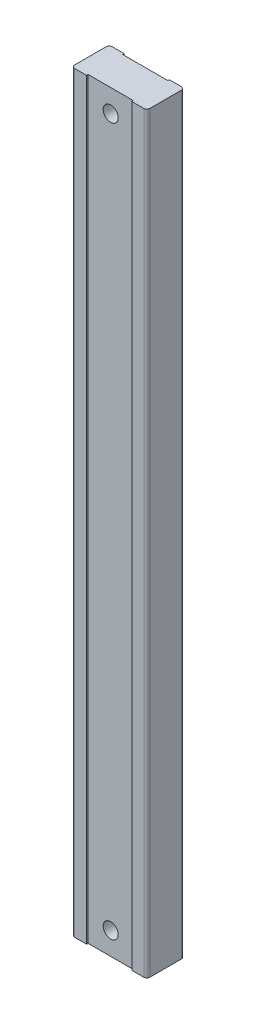
ISO-10303-21;
HEADER;
FILE_DESCRIPTION(('STEP AP214'),'2;1');
FILE_NAME('part.step','',(''),(''),'','','');
FILE_SCHEMA(('AUTOMOTIVE_DESIGN { 1 0 10303 214 1 1 1 1 }'));
ENDSEC;
DATA;
#1=APPLICATION_CONTEXT('core data for automotive mechanical design processes');
#2=APPLICATION_PROTOCOL_DEFINITION('international standard','automotive_design',2000,#1);
#3=PRODUCT_CONTEXT('',#1,'mechanical');
#4=PRODUCT('Part','Part','',(#3));
#5=PRODUCT_RELATED_PRODUCT_CATEGORY('part','',(#4));
#6=PRODUCT_DEFINITION_FORMATION('','',#4);
#7=PRODUCT_DEFINITION_CONTEXT('part definition',#1,'design');
#8=PRODUCT_DEFINITION('design','',#6,#7);
#9=PRODUCT_DEFINITION_SHAPE('','',#8);
#10=(LENGTH_UNIT() NAMED_UNIT(*) SI_UNIT(.MILLI.,.METRE.));
#11=(NAMED_UNIT(*) PLANE_ANGLE_UNIT() SI_UNIT($,.RADIAN.));
#12=(NAMED_UNIT(*) SI_UNIT($,.STERADIAN.) SOLID_ANGLE_UNIT());
#13=UNCERTAINTY_MEASURE_WITH_UNIT(LENGTH_MEASURE(1.E-05),#10,'distance_accuracy_value','');
#14=(GEOMETRIC_REPRESENTATION_CONTEXT(3) GLOBAL_UNCERTAINTY_ASSIGNED_CONTEXT((#13)) GLOBAL_UNIT_ASSIGNED_CONTEXT((#10,
#11,#12)) REPRESENTATION_CONTEXT('',''));
#15=CARTESIAN_POINT('',(0.,0.,0.));
#16=DIRECTION('',(0.,0.,1.));
#17=DIRECTION('',(1.,0.,0.));
#18=AXIS2_PLACEMENT_3D('',#15,#16,#17);
#19=CARTESIAN_POINT('',(-73.9038841324201,500.,23.3090667808219));
#20=DIRECTION('',(0.,0.,-1.));
#21=DIRECTION('',(-1.,0.,0.));
#22=AXIS2_PLACEMENT_3D('',#19,#20,#21);
#23=PLANE('',#22);
#24=DIRECTION('',(1.,0.,0.));
#25=VECTOR('',#24,1.);
#26=CARTESIAN_POINT('',(-73.9038841324201,0.,23.3090667808219));
#27=LINE('',#26,#25);
#28=CARTESIAN_POINT('',(-73.9038841324201,0.,23.3090667808219));
#29=VERTEX_POINT('',#28);
#30=CARTESIAN_POINT('',(-65.9038841324201,0.,23.3090667808219));
#31=VERTEX_POINT('',#30);
#32=EDGE_CURVE('E160',#29,#31,#27,.T.);
#33=ORIENTED_EDGE('',*,*,#32,.T.);
#34=DIRECTION('',(0.,1.,0.));
#35=VECTOR('',#34,1.);
#36=CARTESIAN_POINT('',(-65.9038841324201,0.,23.3090667808219));
#37=LINE('',#36,#35);
#38=CARTESIAN_POINT('',(-65.9038841324201,500.,23.3090667808219));
#39=VERTEX_POINT('',#38);
#40=EDGE_CURVE('E146',#31,#39,#37,.T.);
#41=ORIENTED_EDGE('',*,*,#40,.T.);
#42=DIRECTION('',(1.,0.,0.));
#43=VECTOR('',#42,1.);
#44=CARTESIAN_POINT('',(-73.9038841324201,500.,23.3090667808219));
#45=LINE('',#44,#43);
#46=CARTESIAN_POINT('',(-73.9038841324201,500.,23.3090667808219));
#47=VERTEX_POINT('',#46);
#48=EDGE_CURVE('E254',#47,#39,#45,.T.);
#49=ORIENTED_EDGE('',*,*,#48,.F.);
#50=DIRECTION('',(0.,-1.,0.));
#51=VECTOR('',#50,1.);
#52=CARTESIAN_POINT('',(-73.9038841324201,500.,23.3090667808219));
#53=LINE('',#52,#51);
#54=EDGE_CURVE('E11',#47,#29,#53,.T.);
#55=ORIENTED_EDGE('',*,*,#54,.T.);
#56=EDGE_LOOP('',(#33,#41,#49,#55));
#57=FACE_BOUND('',#56,.T.);
#58=ADVANCED_FACE('F33',(#57),#23,.F.);
#59=CARTESIAN_POINT('',(-73.9038841324201,500.,-1.69093321917808));
#60=DIRECTION('',(0.,0.,1.));
#61=DIRECTION('',(1.,0.,0.));
#62=AXIS2_PLACEMENT_3D('',#59,#60,#61);
#63=PLANE('',#62);
#64=DIRECTION('',(-1.,0.,0.));
#65=VECTOR('',#64,1.);
#66=CARTESIAN_POINT('',(-73.9038841324201,500.,-1.69093321917808));
#67=LINE('',#66,#65);
#68=CARTESIAN_POINT('',(-65.9038841324201,500.,-1.69093321917808));
#69=VERTEX_POINT('',#68);
#70=CARTESIAN_POINT('',(-73.9038841324201,500.,-1.69093321917808));
#71=VERTEX_POINT('',#70);
#72=EDGE_CURVE('E232',#69,#71,#67,.T.);
#73=ORIENTED_EDGE('',*,*,#72,.F.);
#74=DIRECTION('',(0.,1.,0.));
#75=VECTOR('',#74,1.);
#76=CARTESIAN_POINT('',(-65.9038841324201,0.,-1.69093321917808));
#77=LINE('',#76,#75);
#78=CARTESIAN_POINT('',(-65.9038841324201,0.,-1.69093321917808));
#79=VERTEX_POINT('',#78);
#80=EDGE_CURVE('E287',#79,#69,#77,.T.);
#81=ORIENTED_EDGE('',*,*,#80,.F.);
#82=DIRECTION('',(-1.,0.,0.));
#83=VECTOR('',#82,1.);
#84=CARTESIAN_POINT('',(-73.9038841324201,0.,-1.69093321917808));
#85=LINE('',#84,#83);
#86=CARTESIAN_POINT('',(-73.9038841324201,0.,-1.69093321917808));
#87=VERTEX_POINT('',#86);
#88=EDGE_CURVE('E179',#79,#87,#85,.T.);
#89=ORIENTED_EDGE('',*,*,#88,.T.);
#90=DIRECTION('',(0.,-1.,0.));
#91=VECTOR('',#90,1.);
#92=CARTESIAN_POINT('',(-73.9038841324201,500.,-1.69093321917808));
#93=LINE('',#92,#91);
#94=EDGE_CURVE('E195',#71,#87,#93,.T.);
#95=ORIENTED_EDGE('',*,*,#94,.F.);
#96=EDGE_LOOP('',(#73,#81,#89,#95));
#97=FACE_BOUND('',#96,.T.);
#98=ADVANCED_FACE('F308',(#97),#63,.F.);
#99=CARTESIAN_POINT('',(-73.9038841324201,500.,21.3090667808219));
#100=DIRECTION('',(0.,-1.,0.));
#101=DIRECTION('',(0.,0.,-1.));
#102=AXIS2_PLACEMENT_3D('',#99,#100,#101);
#103=CYLINDRICAL_SURFACE('',#102,2.);
#104=CARTESIAN_POINT('',(-73.9038841324201,0.,21.3090667808219));
#105=DIRECTION('',(0.,1.,0.));
#106=DIRECTION('',(0.,0.,-1.));
#107=AXIS2_PLACEMENT_3D('',#104,#105,#106);
#108=CIRCLE('',#107,2.);
#109=CARTESIAN_POINT('',(-75.9038841324201,0.,21.3090667808219));
#110=VERTEX_POINT('',#109);
#111=EDGE_CURVE('E172',#110,#29,#108,.T.);
#112=ORIENTED_EDGE('',*,*,#111,.T.);
#113=ORIENTED_EDGE('',*,*,#54,.F.);
#114=CARTESIAN_POINT('',(-73.9038841324201,500.,21.3090667808219));
#115=DIRECTION('',(0.,1.,0.));
#116=DIRECTION('',(0.,0.,-1.));
#117=AXIS2_PLACEMENT_3D('',#114,#115,#116);
#118=CIRCLE('',#117,2.);
#119=CARTESIAN_POINT('',(-75.9038841324201,500.,21.3090667808219));
#120=VERTEX_POINT('',#119);
#121=EDGE_CURVE('E187',#120,#47,#118,.T.);
#122=ORIENTED_EDGE('',*,*,#121,.F.);
#123=DIRECTION('',(0.,-1.,0.));
#124=VECTOR('',#123,1.);
#125=CARTESIAN_POINT('',(-75.9038841324201,500.,21.3090667808219));
#126=LINE('',#125,#124);
#127=EDGE_CURVE('E188',#120,#110,#126,.T.);
#128=ORIENTED_EDGE('',*,*,#127,.T.);
#129=EDGE_LOOP('',(#112,#113,#122,#128));
#130=FACE_BOUND('',#129,.T.);
#131=ADVANCED_FACE('F35',(#130),#103,.T.);
#132=CARTESIAN_POINT('',(-35.9038841324201,500.,23.3090667808219));
#133=VERTEX_POINT('',#132);
#134=CARTESIAN_POINT('',(-27.9038841324201,500.,23.3090667808219));
#135=VERTEX_POINT('',#134);
#136=EDGE_CURVE('E252',#133,#135,#45,.T.);
#137=ORIENTED_EDGE('',*,*,#136,.F.);
#138=DIRECTION('',(0.,1.,0.));
#139=VECTOR('',#138,1.);
#140=CARTESIAN_POINT('',(-35.9038841324201,0.,23.3090667808219));
#141=LINE('',#140,#139);
#142=CARTESIAN_POINT('',(-35.9038841324201,0.,23.3090667808219));
#143=VERTEX_POINT('',#142);
#144=EDGE_CURVE('E155',#143,#133,#141,.T.);
#145=ORIENTED_EDGE('',*,*,#144,.F.);
#146=CARTESIAN_POINT('',(-27.9038841324201,0.,23.3090667808219));
#147=VERTEX_POINT('',#146);
#148=EDGE_CURVE('E168',#143,#147,#27,.T.);
#149=ORIENTED_EDGE('',*,*,#148,.T.);
#150=DIRECTION('',(0.,-1.,0.));
#151=VECTOR('',#150,1.);
#152=CARTESIAN_POINT('',(-27.9038841324201,500.,23.3090667808219));
#153=LINE('',#152,#151);
#154=EDGE_CURVE('E41',#135,#147,#153,.T.);
#155=ORIENTED_EDGE('',*,*,#154,.F.);
#156=EDGE_LOOP('',(#137,#145,#149,#155));
#157=FACE_BOUND('',#156,.T.);
#158=ADVANCED_FACE('F264',(#157),#23,.F.);
#159=CARTESIAN_POINT('',(-27.9038841324201,500.,21.3090667808219));
#160=DIRECTION('',(0.,-1.,0.));
#161=DIRECTION('',(0.,0.,-1.));
#162=AXIS2_PLACEMENT_3D('',#159,#160,#161);
#163=CYLINDRICAL_SURFACE('',#162,2.);
#164=CARTESIAN_POINT('',(-27.9038841324201,0.,21.3090667808219));
#165=DIRECTION('',(0.,1.,0.));
#166=DIRECTION('',(0.,0.,-1.));
#167=AXIS2_PLACEMENT_3D('',#164,#165,#166);
#168=CIRCLE('',#167,2.);
#169=CARTESIAN_POINT('',(-25.9038841324201,0.,21.3090667808219));
#170=VERTEX_POINT('',#169);
#171=EDGE_CURVE('E167',#147,#170,#168,.T.);
#172=ORIENTED_EDGE('',*,*,#171,.T.);
#173=DIRECTION('',(0.,-1.,0.));
#174=VECTOR('',#173,1.);
#175=CARTESIAN_POINT('',(-25.9038841324201,500.,21.3090667808219));
#176=LINE('',#175,#174);
#177=CARTESIAN_POINT('',(-25.9038841324201,500.,21.3090667808219));
#178=VERTEX_POINT('',#177);
#179=EDGE_CURVE('E204',#178,#170,#176,.T.);
#180=ORIENTED_EDGE('',*,*,#179,.F.);
#181=CARTESIAN_POINT('',(-27.9038841324201,500.,21.3090667808219));
#182=DIRECTION('',(0.,1.,0.));
#183=DIRECTION('',(0.,0.,-1.));
#184=AXIS2_PLACEMENT_3D('',#181,#182,#183);
#185=CIRCLE('',#184,2.);
#186=EDGE_CURVE('E213',#135,#178,#185,.T.);
#187=ORIENTED_EDGE('',*,*,#186,.F.);
#188=ORIENTED_EDGE('',*,*,#154,.T.);
#189=EDGE_LOOP('',(#172,#180,#187,#188));
#190=FACE_BOUND('',#189,.T.);
#191=ADVANCED_FACE('F211',(#190),#163,.T.);
#192=CARTESIAN_POINT('',(-25.9038841324201,500.,0.309066780821921));
#193=DIRECTION('',(-1.,0.,0.));
#194=DIRECTION('',(0.,0.,1.));
#195=AXIS2_PLACEMENT_3D('',#192,#193,#194);
#196=PLANE('',#195);
#197=DIRECTION('',(0.,0.,-1.));
#198=VECTOR('',#197,1.);
#199=CARTESIAN_POINT('',(-25.9038841324201,0.,0.309066780821921));
#200=LINE('',#199,#198);
#201=CARTESIAN_POINT('',(-25.9038841324201,0.,0.309066780821921));
#202=VERTEX_POINT('',#201);
#203=EDGE_CURVE('E170',#170,#202,#200,.T.);
#204=ORIENTED_EDGE('',*,*,#203,.T.);
#205=DIRECTION('',(0.,-1.,0.));
#206=VECTOR('',#205,1.);
#207=CARTESIAN_POINT('',(-25.9038841324201,500.,0.309066780821921));
#208=LINE('',#207,#206);
#209=CARTESIAN_POINT('',(-25.9038841324201,500.,0.309066780821921));
#210=VERTEX_POINT('',#209);
#211=EDGE_CURVE('E201',#210,#202,#208,.T.);
#212=ORIENTED_EDGE('',*,*,#211,.F.);
#213=DIRECTION('',(0.,0.,-1.));
#214=VECTOR('',#213,1.);
#215=CARTESIAN_POINT('',(-25.9038841324201,500.,0.309066780821921));
#216=LINE('',#215,#214);
#217=EDGE_CURVE('E233',#178,#210,#216,.T.);
#218=ORIENTED_EDGE('',*,*,#217,.F.);
#219=ORIENTED_EDGE('',*,*,#179,.T.);
#220=EDGE_LOOP('',(#204,#212,#218,#219));
#221=FACE_BOUND('',#220,.T.);
#222=ADVANCED_FACE('F222',(#221),#196,.F.);
#223=CARTESIAN_POINT('',(-27.9038841324201,500.,0.309066780821921));
#224=DIRECTION('',(0.,-1.,0.));
#225=DIRECTION('',(0.,0.,-1.));
#226=AXIS2_PLACEMENT_3D('',#223,#224,#225);
#227=CYLINDRICAL_SURFACE('',#226,2.);
#228=CARTESIAN_POINT('',(-27.9038841324201,0.,0.309066780821921));
#229=DIRECTION('',(0.,1.,0.));
#230=DIRECTION('',(0.,0.,-1.));
#231=AXIS2_PLACEMENT_3D('',#228,#229,#230);
#232=CIRCLE('',#231,2.);
#233=CARTESIAN_POINT('',(-27.9038841324201,0.,-1.69093321917808));
#234=VERTEX_POINT('',#233);
#235=EDGE_CURVE('E177',#202,#234,#232,.T.);
#236=ORIENTED_EDGE('',*,*,#235,.T.);
#237=DIRECTION('',(0.,-1.,0.));
#238=VECTOR('',#237,1.);
#239=CARTESIAN_POINT('',(-27.9038841324201,500.,-1.69093321917808));
#240=LINE('',#239,#238);
#241=CARTESIAN_POINT('',(-27.9038841324201,500.,-1.69093321917808));
#242=VERTEX_POINT('',#241);
#243=EDGE_CURVE('E198',#242,#234,#240,.T.);
#244=ORIENTED_EDGE('',*,*,#243,.F.);
#245=CARTESIAN_POINT('',(-27.9038841324201,500.,0.309066780821921));
#246=DIRECTION('',(0.,1.,0.));
#247=DIRECTION('',(0.,0.,-1.));
#248=AXIS2_PLACEMENT_3D('',#245,#246,#247);
#249=CIRCLE('',#248,2.);
#250=EDGE_CURVE('E228',#210,#242,#249,.T.);
#251=ORIENTED_EDGE('',*,*,#250,.F.);
#252=ORIENTED_EDGE('',*,*,#211,.T.);
#253=EDGE_LOOP('',(#236,#244,#251,#252));
#254=FACE_BOUND('',#253,.T.);
#255=ADVANCED_FACE('F226',(#254),#227,.T.);
#256=CARTESIAN_POINT('',(-35.9038841324201,0.,-1.69093321917808));
#257=VERTEX_POINT('',#256);
#258=EDGE_CURVE('E180',#234,#257,#85,.T.);
#259=ORIENTED_EDGE('',*,*,#258,.T.);
#260=DIRECTION('',(0.,1.,0.));
#261=VECTOR('',#260,1.);
#262=CARTESIAN_POINT('',(-35.9038841324201,0.,-1.69093321917808));
#263=LINE('',#262,#261);
#264=CARTESIAN_POINT('',(-35.9038841324201,500.,-1.69093321917808));
#265=VERTEX_POINT('',#264);
#266=EDGE_CURVE('E289',#257,#265,#263,.T.);
#267=ORIENTED_EDGE('',*,*,#266,.T.);
#268=EDGE_CURVE('E235',#242,#265,#67,.T.);
#269=ORIENTED_EDGE('',*,*,#268,.F.);
#270=ORIENTED_EDGE('',*,*,#243,.T.);
#271=EDGE_LOOP('',(#259,#267,#269,#270));
#272=FACE_BOUND('',#271,.T.);
#273=ADVANCED_FACE('F304',(#272),#63,.F.);
#274=CARTESIAN_POINT('',(-73.9038841324201,500.,0.309066780821921));
#275=DIRECTION('',(0.,-1.,0.));
#276=DIRECTION('',(0.,0.,-1.));
#277=AXIS2_PLACEMENT_3D('',#274,#275,#276);
#278=CYLINDRICAL_SURFACE('',#277,2.);
#279=CARTESIAN_POINT('',(-73.9038841324201,0.,0.309066780821921));
#280=DIRECTION('',(0.,1.,0.));
#281=DIRECTION('',(0.,0.,1.));
#282=AXIS2_PLACEMENT_3D('',#279,#280,#281);
#283=CIRCLE('',#282,2.);
#284=CARTESIAN_POINT('',(-75.9038841324201,0.,0.309066780821921));
#285=VERTEX_POINT('',#284);
#286=EDGE_CURVE('E183',#87,#285,#283,.T.);
#287=ORIENTED_EDGE('',*,*,#286,.T.);
#288=DIRECTION('',(0.,-1.,0.));
#289=VECTOR('',#288,1.);
#290=CARTESIAN_POINT('',(-75.9038841324201,500.,0.309066780821921));
#291=LINE('',#290,#289);
#292=CARTESIAN_POINT('',(-75.9038841324201,500.,0.309066780821921));
#293=VERTEX_POINT('',#292);
#294=EDGE_CURVE('E191',#293,#285,#291,.T.);
#295=ORIENTED_EDGE('',*,*,#294,.F.);
#296=CARTESIAN_POINT('',(-73.9038841324201,500.,0.309066780821921));
#297=DIRECTION('',(0.,1.,0.));
#298=DIRECTION('',(0.,0.,1.));
#299=AXIS2_PLACEMENT_3D('',#296,#297,#298);
#300=CIRCLE('',#299,2.);
#301=EDGE_CURVE('E240',#71,#293,#300,.T.);
#302=ORIENTED_EDGE('',*,*,#301,.F.);
#303=ORIENTED_EDGE('',*,*,#94,.T.);
#304=EDGE_LOOP('',(#287,#295,#302,#303));
#305=FACE_BOUND('',#304,.T.);
#306=ADVANCED_FACE('F311',(#305),#278,.T.);
#307=CARTESIAN_POINT('',(-75.9038841324201,500.,0.309066780821921));
#308=DIRECTION('',(1.,0.,0.));
#309=DIRECTION('',(0.,0.,-1.));
#310=AXIS2_PLACEMENT_3D('',#307,#308,#309);
#311=PLANE('',#310);
#312=DIRECTION('',(0.,0.,1.));
#313=VECTOR('',#312,1.);
#314=CARTESIAN_POINT('',(-75.9038841324201,0.,0.309066780821921));
#315=LINE('',#314,#313);
#316=EDGE_CURVE('E185',#285,#110,#315,.T.);
#317=ORIENTED_EDGE('',*,*,#316,.T.);
#318=ORIENTED_EDGE('',*,*,#127,.F.);
#319=DIRECTION('',(0.,0.,1.));
#320=VECTOR('',#319,1.);
#321=CARTESIAN_POINT('',(-75.9038841324201,500.,0.309066780821921));
#322=LINE('',#321,#320);
#323=EDGE_CURVE('E192',#293,#120,#322,.T.);
#324=ORIENTED_EDGE('',*,*,#323,.F.);
#325=ORIENTED_EDGE('',*,*,#294,.T.);
#326=EDGE_LOOP('',(#317,#318,#324,#325));
#327=FACE_BOUND('',#326,.T.);
#328=ADVANCED_FACE('F249',(#327),#311,.F.);
#329=CARTESIAN_POINT('',(-73.9038841324201,500.,21.3090667808219));
#330=DIRECTION('',(0.,-1.,0.));
#331=DIRECTION('',(0.,0.,-1.));
#332=AXIS2_PLACEMENT_3D('',#329,#330,#331);
#333=PLANE('',#332);
#334=ORIENTED_EDGE('',*,*,#48,.T.);
#335=DIRECTION('',(0.,0.,1.));
#336=VECTOR('',#335,1.);
#337=CARTESIAN_POINT('',(-65.9038841324201,500.,23.3090667808219));
#338=LINE('',#337,#336);
#339=CARTESIAN_POINT('',(-65.9038841324201,500.,22.3090667808219));
#340=VERTEX_POINT('',#339);
#341=EDGE_CURVE('E151',#340,#39,#338,.T.);
#342=ORIENTED_EDGE('',*,*,#341,.F.);
#343=DIRECTION('',(-1.,0.,0.));
#344=VECTOR('',#343,1.);
#345=CARTESIAN_POINT('',(-65.9038841324201,500.,22.3090667808219));
#346=LINE('',#345,#344);
#347=CARTESIAN_POINT('',(-35.9038841324201,500.,22.3090667808219));
#348=VERTEX_POINT('',#347);
#349=EDGE_CURVE('E163',#348,#340,#346,.T.);
#350=ORIENTED_EDGE('',*,*,#349,.F.);
#351=DIRECTION('',(0.,0.,-1.));
#352=VECTOR('',#351,1.);
#353=CARTESIAN_POINT('',(-35.9038841324201,500.,23.3090667808219));
#354=LINE('',#353,#352);
#355=EDGE_CURVE('E262',#133,#348,#354,.T.);
#356=ORIENTED_EDGE('',*,*,#355,.F.);
#357=ORIENTED_EDGE('',*,*,#136,.T.);
#358=ORIENTED_EDGE('',*,*,#186,.T.);
#359=ORIENTED_EDGE('',*,*,#217,.T.);
#360=ORIENTED_EDGE('',*,*,#250,.T.);
#361=ORIENTED_EDGE('',*,*,#268,.T.);
#362=DIRECTION('',(0.,0.,-1.));
#363=VECTOR('',#362,1.);
#364=CARTESIAN_POINT('',(-35.9038841324201,500.,-1.69093321917808));
#365=LINE('',#364,#363);
#366=CARTESIAN_POINT('',(-35.9038841324201,500.,-0.690933219178078));
#367=VERTEX_POINT('',#366);
#368=EDGE_CURVE('E276',#367,#265,#365,.T.);
#369=ORIENTED_EDGE('',*,*,#368,.F.);
#370=DIRECTION('',(1.,0.,0.));
#371=VECTOR('',#370,1.);
#372=CARTESIAN_POINT('',(-65.9038841324201,500.,-0.690933219178078));
#373=LINE('',#372,#371);
#374=CARTESIAN_POINT('',(-65.9038841324201,500.,-0.690933219178078));
#375=VERTEX_POINT('',#374);
#376=EDGE_CURVE('E283',#375,#367,#373,.T.);
#377=ORIENTED_EDGE('',*,*,#376,.F.);
#378=DIRECTION('',(0.,0.,1.));
#379=VECTOR('',#378,1.);
#380=CARTESIAN_POINT('',(-65.9038841324201,500.,-1.69093321917808));
#381=LINE('',#380,#379);
#382=EDGE_CURVE('E280',#69,#375,#381,.T.);
#383=ORIENTED_EDGE('',*,*,#382,.F.);
#384=ORIENTED_EDGE('',*,*,#72,.T.);
#385=ORIENTED_EDGE('',*,*,#301,.T.);
#386=ORIENTED_EDGE('',*,*,#323,.T.);
#387=ORIENTED_EDGE('',*,*,#121,.T.);
#388=EDGE_LOOP('',(#334,#342,#350,#356,#357,#358,#359,#360,#361,#369,#377,#383,#384,#385,#386,#387));
#389=FACE_BOUND('',#388,.T.);
#390=ADVANCED_FACE('F244',(#389),#333,.F.);
#391=CARTESIAN_POINT('',(-73.9038841324201,0.,21.3090667808219));
#392=DIRECTION('',(0.,-1.,0.));
#393=DIRECTION('',(0.,0.,-1.));
#394=AXIS2_PLACEMENT_3D('',#391,#392,#393);
#395=PLANE('',#394);
#396=DIRECTION('',(0.,0.,1.));
#397=VECTOR('',#396,1.);
#398=CARTESIAN_POINT('',(-65.9038841324201,0.,23.3090667808219));
#399=LINE('',#398,#397);
#400=CARTESIAN_POINT('',(-65.9038841324201,0.,22.3090667808219));
#401=VERTEX_POINT('',#400);
#402=EDGE_CURVE('E149',#401,#31,#399,.T.);
#403=ORIENTED_EDGE('',*,*,#402,.T.);
#404=ORIENTED_EDGE('',*,*,#32,.F.);
#405=ORIENTED_EDGE('',*,*,#111,.F.);
#406=ORIENTED_EDGE('',*,*,#316,.F.);
#407=ORIENTED_EDGE('',*,*,#286,.F.);
#408=ORIENTED_EDGE('',*,*,#88,.F.);
#409=DIRECTION('',(0.,0.,1.));
#410=VECTOR('',#409,1.);
#411=CARTESIAN_POINT('',(-65.9038841324201,0.,-1.69093321917808));
#412=LINE('',#411,#410);
#413=CARTESIAN_POINT('',(-65.9038841324201,0.,-0.690933219178078));
#414=VERTEX_POINT('',#413);
#415=EDGE_CURVE('E272',#79,#414,#412,.T.);
#416=ORIENTED_EDGE('',*,*,#415,.T.);
#417=DIRECTION('',(1.,0.,0.));
#418=VECTOR('',#417,1.);
#419=CARTESIAN_POINT('',(-65.9038841324201,0.,-0.690933219178078));
#420=LINE('',#419,#418);
#421=CARTESIAN_POINT('',(-35.9038841324201,0.,-0.690933219178076));
#422=VERTEX_POINT('',#421);
#423=EDGE_CURVE('E275',#414,#422,#420,.T.);
#424=ORIENTED_EDGE('',*,*,#423,.T.);
#425=DIRECTION('',(0.,0.,-1.));
#426=VECTOR('',#425,1.);
#427=CARTESIAN_POINT('',(-35.9038841324201,0.,-1.69093321917808));
#428=LINE('',#427,#426);
#429=EDGE_CURVE('E56',#422,#257,#428,.T.);
#430=ORIENTED_EDGE('',*,*,#429,.T.);
#431=ORIENTED_EDGE('',*,*,#258,.F.);
#432=ORIENTED_EDGE('',*,*,#235,.F.);
#433=ORIENTED_EDGE('',*,*,#203,.F.);
#434=ORIENTED_EDGE('',*,*,#171,.F.);
#435=ORIENTED_EDGE('',*,*,#148,.F.);
#436=DIRECTION('',(0.,0.,-1.));
#437=VECTOR('',#436,1.);
#438=CARTESIAN_POINT('',(-35.9038841324201,0.,23.3090667808219));
#439=LINE('',#438,#437);
#440=CARTESIAN_POINT('',(-35.9038841324201,0.,22.3090667808219));
#441=VERTEX_POINT('',#440);
#442=EDGE_CURVE('E162',#143,#441,#439,.T.);
#443=ORIENTED_EDGE('',*,*,#442,.T.);
#444=DIRECTION('',(-1.,0.,0.));
#445=VECTOR('',#444,1.);
#446=CARTESIAN_POINT('',(-65.9038841324201,0.,22.3090667808219));
#447=LINE('',#446,#445);
#448=EDGE_CURVE('E48',#441,#401,#447,.T.);
#449=ORIENTED_EDGE('',*,*,#448,.T.);
#450=EDGE_LOOP('',(#403,#404,#405,#406,#407,#408,#416,#424,#430,#431,#432,#433,#434,#435,#443,#449));
#451=FACE_BOUND('',#450,.T.);
#452=ADVANCED_FACE('F158',(#451),#395,.T.);
#453=CARTESIAN_POINT('',(-65.9038841324201,0.,-1.69093321917808));
#454=DIRECTION('',(-1.,0.,0.));
#455=DIRECTION('',(0.,0.,1.));
#456=AXIS2_PLACEMENT_3D('',#453,#454,#455);
#457=PLANE('',#456);
#458=ORIENTED_EDGE('',*,*,#382,.T.);
#459=DIRECTION('',(0.,1.,0.));
#460=VECTOR('',#459,1.);
#461=CARTESIAN_POINT('',(-65.9038841324201,0.,-0.690933219178078));
#462=LINE('',#461,#460);
#463=EDGE_CURVE('E257',#414,#375,#462,.T.);
#464=ORIENTED_EDGE('',*,*,#463,.F.);
#465=ORIENTED_EDGE('',*,*,#415,.F.);
#466=ORIENTED_EDGE('',*,*,#80,.T.);
#467=EDGE_LOOP('',(#458,#464,#465,#466));
#468=FACE_BOUND('',#467,.T.);
#469=ADVANCED_FACE('F299',(#468),#457,.F.);
#470=CARTESIAN_POINT('',(-35.9038841324201,0.,-1.69093321917808));
#471=DIRECTION('',(1.,0.,0.));
#472=DIRECTION('',(0.,0.,-1.));
#473=AXIS2_PLACEMENT_3D('',#470,#471,#472);
#474=PLANE('',#473);
#475=ORIENTED_EDGE('',*,*,#368,.T.);
#476=ORIENTED_EDGE('',*,*,#266,.F.);
#477=ORIENTED_EDGE('',*,*,#429,.F.);
#478=DIRECTION('',(0.,1.,0.));
#479=VECTOR('',#478,1.);
#480=CARTESIAN_POINT('',(-35.9038841324201,0.,-0.690933219178078));
#481=LINE('',#480,#479);
#482=EDGE_CURVE('E291',#422,#367,#481,.T.);
#483=ORIENTED_EDGE('',*,*,#482,.T.);
#484=EDGE_LOOP('',(#475,#476,#477,#483));
#485=FACE_BOUND('',#484,.T.);
#486=ADVANCED_FACE('F302',(#485),#474,.F.);
#487=CARTESIAN_POINT('',(-65.9038841324201,0.,-0.690933219178078));
#488=DIRECTION('',(0.,0.,1.));
#489=DIRECTION('',(1.,0.,0.));
#490=AXIS2_PLACEMENT_3D('',#487,#488,#489);
#491=PLANE('',#490);
#492=CARTESIAN_POINT('',(-50.9038841324201,485.,-0.690933219178076));
#493=DIRECTION('',(0.,0.,1.));
#494=DIRECTION('',(1.,0.,0.));
#495=AXIS2_PLACEMENT_3D('',#492,#493,#494);
#496=CIRCLE('',#495,4.99999999999999);
#497=CARTESIAN_POINT('',(-45.9038841324201,485.,-0.690933219178076));
#498=VERTEX_POINT('',#497);
#499=EDGE_CURVE('E453',#498,#498,#496,.T.);
#500=ORIENTED_EDGE('',*,*,#499,.T.);
#501=EDGE_LOOP('',(#500));
#502=FACE_BOUND('',#501,.T.);
#503=CARTESIAN_POINT('',(-50.9038841324201,15.,-0.690933219178076));
#504=DIRECTION('',(0.,0.,1.));
#505=DIRECTION('',(1.,0.,0.));
#506=AXIS2_PLACEMENT_3D('',#503,#504,#505);
#507=CIRCLE('',#506,4.99999999999999);
#508=CARTESIAN_POINT('',(-45.9038841324201,15.,-0.690933219178076));
#509=VERTEX_POINT('',#508);
#510=EDGE_CURVE('E457',#509,#509,#507,.T.);
#511=ORIENTED_EDGE('',*,*,#510,.T.);
#512=EDGE_LOOP('',(#511));
#513=FACE_BOUND('',#512,.T.);
#514=ORIENTED_EDGE('',*,*,#376,.T.);
#515=ORIENTED_EDGE('',*,*,#482,.F.);
#516=ORIENTED_EDGE('',*,*,#423,.F.);
#517=ORIENTED_EDGE('',*,*,#463,.T.);
#518=EDGE_LOOP('',(#514,#515,#516,#517));
#519=FACE_BOUND('',#518,.T.);
#520=ADVANCED_FACE('F294',(#502,#513,#519),#491,.F.);
#521=CARTESIAN_POINT('',(-65.9038841324201,0.,23.3090667808219));
#522=DIRECTION('',(-1.,0.,0.));
#523=DIRECTION('',(0.,0.,1.));
#524=AXIS2_PLACEMENT_3D('',#521,#522,#523);
#525=PLANE('',#524);
#526=ORIENTED_EDGE('',*,*,#341,.T.);
#527=ORIENTED_EDGE('',*,*,#40,.F.);
#528=ORIENTED_EDGE('',*,*,#402,.F.);
#529=DIRECTION('',(0.,1.,0.));
#530=VECTOR('',#529,1.);
#531=CARTESIAN_POINT('',(-65.9038841324201,0.,22.3090667808219));
#532=LINE('',#531,#530);
#533=EDGE_CURVE('E268',#401,#340,#532,.T.);
#534=ORIENTED_EDGE('',*,*,#533,.T.);
#535=EDGE_LOOP('',(#526,#527,#528,#534));
#536=FACE_BOUND('',#535,.T.);
#537=ADVANCED_FACE('F148',(#536),#525,.F.);
#538=CARTESIAN_POINT('',(-65.9038841324201,0.,22.3090667808219));
#539=DIRECTION('',(0.,0.,-1.));
#540=DIRECTION('',(-1.,0.,0.));
#541=AXIS2_PLACEMENT_3D('',#538,#539,#540);
#542=PLANE('',#541);
#543=CARTESIAN_POINT('',(-50.9038841324201,485.,22.3090667808219));
#544=DIRECTION('',(0.,0.,1.));
#545=DIRECTION('',(1.,0.,0.));
#546=AXIS2_PLACEMENT_3D('',#543,#544,#545);
#547=CIRCLE('',#546,5.);
#548=CARTESIAN_POINT('',(-45.9038841324201,485.,22.3090667808219));
#549=VERTEX_POINT('',#548);
#550=EDGE_CURVE('E450',#549,#549,#547,.T.);
#551=ORIENTED_EDGE('',*,*,#550,.F.);
#552=EDGE_LOOP('',(#551));
#553=FACE_BOUND('',#552,.T.);
#554=CARTESIAN_POINT('',(-50.9038841324201,15.,22.3090667808219));
#555=DIRECTION('',(0.,0.,1.));
#556=DIRECTION('',(1.,0.,0.));
#557=AXIS2_PLACEMENT_3D('',#554,#555,#556);
#558=CIRCLE('',#557,5.);
#559=CARTESIAN_POINT('',(-45.9038841324201,15.,22.3090667808219));
#560=VERTEX_POINT('',#559);
#561=EDGE_CURVE('E454',#560,#560,#558,.T.);
#562=ORIENTED_EDGE('',*,*,#561,.F.);
#563=EDGE_LOOP('',(#562));
#564=FACE_BOUND('',#563,.T.);
#565=ORIENTED_EDGE('',*,*,#349,.T.);
#566=ORIENTED_EDGE('',*,*,#533,.F.);
#567=ORIENTED_EDGE('',*,*,#448,.F.);
#568=DIRECTION('',(0.,1.,0.));
#569=VECTOR('',#568,1.);
#570=CARTESIAN_POINT('',(-35.9038841324201,0.,22.3090667808219));
#571=LINE('',#570,#569);
#572=EDGE_CURVE('E266',#441,#348,#571,.T.);
#573=ORIENTED_EDGE('',*,*,#572,.T.);
#574=EDGE_LOOP('',(#565,#566,#567,#573));
#575=FACE_BOUND('',#574,.T.);
#576=ADVANCED_FACE('F398',(#553,#564,#575),#542,.F.);
#577=CARTESIAN_POINT('',(-35.9038841324201,0.,23.3090667808219));
#578=DIRECTION('',(1.,0.,0.));
#579=DIRECTION('',(0.,0.,-1.));
#580=AXIS2_PLACEMENT_3D('',#577,#578,#579);
#581=PLANE('',#580);
#582=ORIENTED_EDGE('',*,*,#355,.T.);
#583=ORIENTED_EDGE('',*,*,#572,.F.);
#584=ORIENTED_EDGE('',*,*,#442,.F.);
#585=ORIENTED_EDGE('',*,*,#144,.T.);
#586=EDGE_LOOP('',(#582,#583,#584,#585));
#587=FACE_BOUND('',#586,.T.);
#588=ADVANCED_FACE('F405',(#587),#581,.F.);
#589=CARTESIAN_POINT('',(-50.9038841324201,15.,22.3090667808219));
#590=DIRECTION('',(0.,0.,1.));
#591=DIRECTION('',(1.,0.,0.));
#592=AXIS2_PLACEMENT_3D('',#589,#590,#591);
#593=CYLINDRICAL_SURFACE('',#592,4.99999999999999);
#594=ORIENTED_EDGE('',*,*,#561,.T.);
#595=EDGE_LOOP('',(#594));
#596=FACE_BOUND('',#595,.T.);
#597=ORIENTED_EDGE('',*,*,#510,.F.);
#598=EDGE_LOOP('',(#597));
#599=FACE_BOUND('',#598,.T.);
#600=ADVANCED_FACE('F410',(#596,#599),#593,.F.);
#601=CARTESIAN_POINT('',(-50.9038841324201,485.,22.3090667808219));
#602=DIRECTION('',(0.,0.,1.));
#603=DIRECTION('',(1.,0.,0.));
#604=AXIS2_PLACEMENT_3D('',#601,#602,#603);
#605=CYLINDRICAL_SURFACE('',#604,4.99999999999999);
#606=ORIENTED_EDGE('',*,*,#550,.T.);
#607=EDGE_LOOP('',(#606));
#608=FACE_BOUND('',#607,.T.);
#609=ORIENTED_EDGE('',*,*,#499,.F.);
#610=EDGE_LOOP('',(#609));
#611=FACE_BOUND('',#610,.T.);
#612=ADVANCED_FACE('F433',(#608,#611),#605,.F.);
#613=CLOSED_SHELL('',(#58,#98,#131,#158,#191,#222,#255,#273,#306,#328,#390,#452,#469,#486,#520,
#537,#576,#588,#600,#612));
#614=MANIFOLD_SOLID_BREP('B2',#613);
#615=ADVANCED_BREP_SHAPE_REPRESENTATION('',(#18,#614),#14);
#616=SHAPE_DEFINITION_REPRESENTATION(#9,#615);
ENDSEC;
END-ISO-10303-21;
